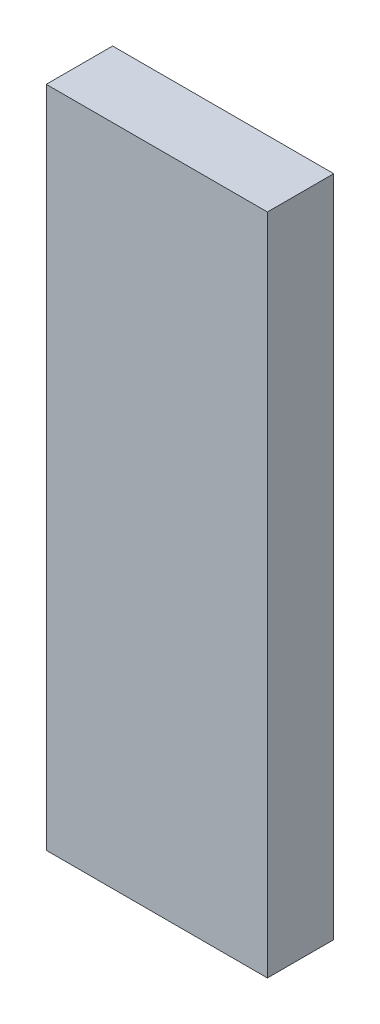
ISO-10303-21;
HEADER;
FILE_DESCRIPTION(('STEP AP214'),'2;1');
FILE_NAME('part.step','',(''),(''),'','','');
FILE_SCHEMA(('AUTOMOTIVE_DESIGN { 1 0 10303 214 1 1 1 1 }'));
ENDSEC;
DATA;
#1=APPLICATION_CONTEXT('core data for automotive mechanical design processes');
#2=APPLICATION_PROTOCOL_DEFINITION('international standard','automotive_design',2000,#1);
#3=PRODUCT_CONTEXT('',#1,'mechanical');
#4=PRODUCT('Part','Part','',(#3));
#5=PRODUCT_RELATED_PRODUCT_CATEGORY('part','',(#4));
#6=PRODUCT_DEFINITION_FORMATION('','',#4);
#7=PRODUCT_DEFINITION_CONTEXT('part definition',#1,'design');
#8=PRODUCT_DEFINITION('design','',#6,#7);
#9=PRODUCT_DEFINITION_SHAPE('','',#8);
#10=(LENGTH_UNIT() NAMED_UNIT(*) SI_UNIT(.MILLI.,.METRE.));
#11=(NAMED_UNIT(*) PLANE_ANGLE_UNIT() SI_UNIT($,.RADIAN.));
#12=(NAMED_UNIT(*) SI_UNIT($,.STERADIAN.) SOLID_ANGLE_UNIT());
#13=UNCERTAINTY_MEASURE_WITH_UNIT(LENGTH_MEASURE(1.E-05),#10,'distance_accuracy_value','');
#14=(GEOMETRIC_REPRESENTATION_CONTEXT(3) GLOBAL_UNCERTAINTY_ASSIGNED_CONTEXT((#13)) GLOBAL_UNIT_ASSIGNED_CONTEXT((#10,
#11,#12)) REPRESENTATION_CONTEXT('',''));
#15=CARTESIAN_POINT('',(0.,0.,0.));
#16=DIRECTION('',(0.,0.,1.));
#17=DIRECTION('',(1.,0.,0.));
#18=AXIS2_PLACEMENT_3D('',#15,#16,#17);
#19=CARTESIAN_POINT('',(5.00000000000002,30.,-1.50000000000001));
#20=DIRECTION('',(-1.,0.,0.));
#21=DIRECTION('',(0.,0.,1.));
#22=AXIS2_PLACEMENT_3D('',#19,#20,#21);
#23=PLANE('',#22);
#24=DIRECTION('',(0.,0.,-1.));
#25=VECTOR('',#24,1.);
#26=CARTESIAN_POINT('',(5.00000000000002,0.,-1.50000000000001));
#27=LINE('',#26,#25);
#28=CARTESIAN_POINT('',(5.00000000000002,0.,1.49999999999999));
#29=VERTEX_POINT('',#28);
#30=CARTESIAN_POINT('',(5.00000000000002,0.,-1.50000000000001));
#31=VERTEX_POINT('',#30);
#32=EDGE_CURVE('E96',#29,#31,#27,.T.);
#33=ORIENTED_EDGE('',*,*,#32,.T.);
#34=DIRECTION('',(0.,-1.,0.));
#35=VECTOR('',#34,1.);
#36=CARTESIAN_POINT('',(5.00000000000002,30.,-1.50000000000001));
#37=LINE('',#36,#35);
#38=CARTESIAN_POINT('',(5.00000000000002,30.,-1.50000000000001));
#39=VERTEX_POINT('',#38);
#40=EDGE_CURVE('E11',#39,#31,#37,.T.);
#41=ORIENTED_EDGE('',*,*,#40,.F.);
#42=DIRECTION('',(0.,0.,-1.));
#43=VECTOR('',#42,1.);
#44=CARTESIAN_POINT('',(5.00000000000002,30.,-1.50000000000001));
#45=LINE('',#44,#43);
#46=CARTESIAN_POINT('',(5.00000000000002,30.,1.49999999999999));
#47=VERTEX_POINT('',#46);
#48=EDGE_CURVE('E84',#47,#39,#45,.T.);
#49=ORIENTED_EDGE('',*,*,#48,.F.);
#50=DIRECTION('',(0.,-1.,0.));
#51=VECTOR('',#50,1.);
#52=CARTESIAN_POINT('',(5.00000000000002,30.,1.49999999999999));
#53=LINE('',#52,#51);
#54=EDGE_CURVE('E92',#47,#29,#53,.T.);
#55=ORIENTED_EDGE('',*,*,#54,.T.);
#56=EDGE_LOOP('',(#33,#41,#49,#55));
#57=FACE_BOUND('',#56,.T.);
#58=ADVANCED_FACE('F33',(#57),#23,.F.);
#59=CARTESIAN_POINT('',(-4.99999999999998,30.,-1.50000000000001));
#60=DIRECTION('',(0.,0.,1.));
#61=DIRECTION('',(1.,0.,0.));
#62=AXIS2_PLACEMENT_3D('',#59,#60,#61);
#63=PLANE('',#62);
#64=DIRECTION('',(-1.,0.,0.));
#65=VECTOR('',#64,1.);
#66=CARTESIAN_POINT('',(-4.99999999999998,0.,-1.50000000000001));
#67=LINE('',#66,#65);
#68=CARTESIAN_POINT('',(-4.99999999999998,0.,-1.50000000000001));
#69=VERTEX_POINT('',#68);
#70=EDGE_CURVE('E88',#31,#69,#67,.T.);
#71=ORIENTED_EDGE('',*,*,#70,.T.);
#72=DIRECTION('',(0.,-1.,0.));
#73=VECTOR('',#72,1.);
#74=CARTESIAN_POINT('',(-4.99999999999998,30.,-1.50000000000001));
#75=LINE('',#74,#73);
#76=CARTESIAN_POINT('',(-4.99999999999998,30.,-1.50000000000001));
#77=VERTEX_POINT('',#76);
#78=EDGE_CURVE('E41',#77,#69,#75,.T.);
#79=ORIENTED_EDGE('',*,*,#78,.F.);
#80=DIRECTION('',(-1.,0.,0.));
#81=VECTOR('',#80,1.);
#82=CARTESIAN_POINT('',(-4.99999999999998,30.,-1.50000000000001));
#83=LINE('',#82,#81);
#84=EDGE_CURVE('E79',#39,#77,#83,.T.);
#85=ORIENTED_EDGE('',*,*,#84,.F.);
#86=ORIENTED_EDGE('',*,*,#40,.T.);
#87=EDGE_LOOP('',(#71,#79,#85,#86));
#88=FACE_BOUND('',#87,.T.);
#89=ADVANCED_FACE('F87',(#88),#63,.F.);
#90=CARTESIAN_POINT('',(-4.99999999999998,30.,-1.50000000000001));
#91=DIRECTION('',(1.,0.,0.));
#92=DIRECTION('',(0.,0.,-1.));
#93=AXIS2_PLACEMENT_3D('',#90,#91,#92);
#94=PLANE('',#93);
#95=DIRECTION('',(0.,0.,1.));
#96=VECTOR('',#95,1.);
#97=CARTESIAN_POINT('',(-4.99999999999998,0.,-1.50000000000001));
#98=LINE('',#97,#96);
#99=CARTESIAN_POINT('',(-4.99999999999998,0.,1.49999999999999));
#100=VERTEX_POINT('',#99);
#101=EDGE_CURVE('E66',#69,#100,#98,.T.);
#102=ORIENTED_EDGE('',*,*,#101,.T.);
#103=DIRECTION('',(0.,-1.,0.));
#104=VECTOR('',#103,1.);
#105=CARTESIAN_POINT('',(-4.99999999999998,30.,1.49999999999999));
#106=LINE('',#105,#104);
#107=CARTESIAN_POINT('',(-4.99999999999998,30.,1.49999999999999));
#108=VERTEX_POINT('',#107);
#109=EDGE_CURVE('E89',#108,#100,#106,.T.);
#110=ORIENTED_EDGE('',*,*,#109,.F.);
#111=DIRECTION('',(0.,0.,1.));
#112=VECTOR('',#111,1.);
#113=CARTESIAN_POINT('',(-4.99999999999998,30.,-1.50000000000001));
#114=LINE('',#113,#112);
#115=EDGE_CURVE('E82',#77,#108,#114,.T.);
#116=ORIENTED_EDGE('',*,*,#115,.F.);
#117=ORIENTED_EDGE('',*,*,#78,.T.);
#118=EDGE_LOOP('',(#102,#110,#116,#117));
#119=FACE_BOUND('',#118,.T.);
#120=ADVANCED_FACE('F90',(#119),#94,.F.);
#121=CARTESIAN_POINT('',(-4.99999999999998,30.,1.49999999999999));
#122=DIRECTION('',(0.,0.,-1.));
#123=DIRECTION('',(-1.,0.,0.));
#124=AXIS2_PLACEMENT_3D('',#121,#122,#123);
#125=PLANE('',#124);
#126=DIRECTION('',(1.,0.,0.));
#127=VECTOR('',#126,1.);
#128=CARTESIAN_POINT('',(-4.99999999999998,0.,1.49999999999999));
#129=LINE('',#128,#127);
#130=EDGE_CURVE('E72',#100,#29,#129,.T.);
#131=ORIENTED_EDGE('',*,*,#130,.T.);
#132=ORIENTED_EDGE('',*,*,#54,.F.);
#133=DIRECTION('',(1.,0.,0.));
#134=VECTOR('',#133,1.);
#135=CARTESIAN_POINT('',(-4.99999999999998,30.,1.49999999999999));
#136=LINE('',#135,#134);
#137=EDGE_CURVE('E49',#108,#47,#136,.T.);
#138=ORIENTED_EDGE('',*,*,#137,.F.);
#139=ORIENTED_EDGE('',*,*,#109,.T.);
#140=EDGE_LOOP('',(#131,#132,#138,#139));
#141=FACE_BOUND('',#140,.T.);
#142=ADVANCED_FACE('F103',(#141),#125,.F.);
#143=CARTESIAN_POINT('',(0.,30.,0.));
#144=DIRECTION('',(0.,1.,0.));
#145=DIRECTION('',(0.,0.,1.));
#146=AXIS2_PLACEMENT_3D('',#143,#144,#145);
#147=PLANE('',#146);
#148=ORIENTED_EDGE('',*,*,#48,.T.);
#149=ORIENTED_EDGE('',*,*,#84,.T.);
#150=ORIENTED_EDGE('',*,*,#115,.T.);
#151=ORIENTED_EDGE('',*,*,#137,.T.);
#152=EDGE_LOOP('',(#148,#149,#150,#151));
#153=FACE_BOUND('',#152,.T.);
#154=ADVANCED_FACE('F80',(#153),#147,.T.);
#155=CARTESIAN_POINT('',(0.,0.,0.));
#156=DIRECTION('',(0.,1.,0.));
#157=DIRECTION('',(0.,0.,1.));
#158=AXIS2_PLACEMENT_3D('',#155,#156,#157);
#159=PLANE('',#158);
#160=ORIENTED_EDGE('',*,*,#32,.F.);
#161=ORIENTED_EDGE('',*,*,#130,.F.);
#162=ORIENTED_EDGE('',*,*,#101,.F.);
#163=ORIENTED_EDGE('',*,*,#70,.F.);
#164=EDGE_LOOP('',(#160,#161,#162,#163));
#165=FACE_BOUND('',#164,.T.);
#166=ADVANCED_FACE('F106',(#165),#159,.F.);
#167=CLOSED_SHELL('',(#58,#89,#120,#142,#154,#166));
#168=MANIFOLD_SOLID_BREP('B2',#167);
#169=ADVANCED_BREP_SHAPE_REPRESENTATION('',(#18,#168),#14);
#170=SHAPE_DEFINITION_REPRESENTATION(#9,#169);
ENDSEC;
END-ISO-10303-21;
